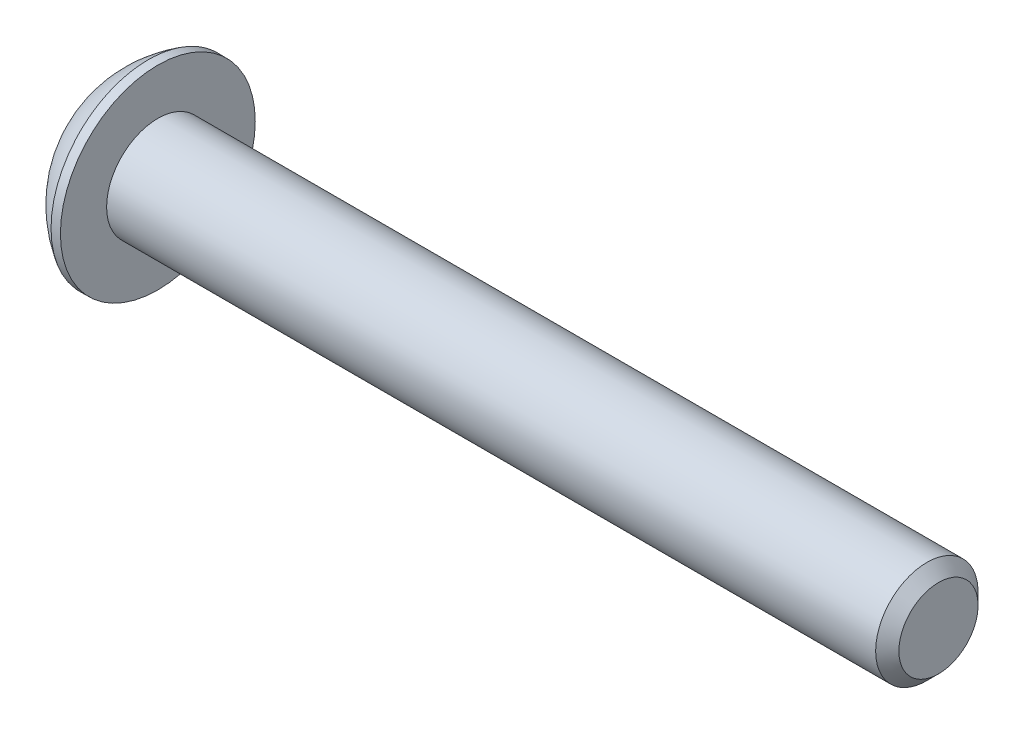
ISO-10303-21;
HEADER;
FILE_DESCRIPTION(('STEP AP214'),'2;1');
FILE_NAME('part.step','',(''),(''),'','','');
FILE_SCHEMA(('AUTOMOTIVE_DESIGN { 1 0 10303 214 1 1 1 1 }'));
ENDSEC;
DATA;
#1=APPLICATION_CONTEXT('core data for automotive mechanical design processes');
#2=APPLICATION_PROTOCOL_DEFINITION('international standard','automotive_design',2000,#1);
#3=PRODUCT_CONTEXT('',#1,'mechanical');
#4=PRODUCT('Part','Part','',(#3));
#5=PRODUCT_RELATED_PRODUCT_CATEGORY('part','',(#4));
#6=PRODUCT_DEFINITION_FORMATION('','',#4);
#7=PRODUCT_DEFINITION_CONTEXT('part definition',#1,'design');
#8=PRODUCT_DEFINITION('design','',#6,#7);
#9=PRODUCT_DEFINITION_SHAPE('','',#8);
#10=(LENGTH_UNIT() NAMED_UNIT(*) SI_UNIT(.MILLI.,.METRE.));
#11=(NAMED_UNIT(*) PLANE_ANGLE_UNIT() SI_UNIT($,.RADIAN.));
#12=(NAMED_UNIT(*) SI_UNIT($,.STERADIAN.) SOLID_ANGLE_UNIT());
#13=UNCERTAINTY_MEASURE_WITH_UNIT(LENGTH_MEASURE(1.E-05),#10,'distance_accuracy_value','');
#14=(GEOMETRIC_REPRESENTATION_CONTEXT(3) GLOBAL_UNCERTAINTY_ASSIGNED_CONTEXT((#13)) GLOBAL_UNIT_ASSIGNED_CONTEXT((#10,
#11,#12)) REPRESENTATION_CONTEXT('',''));
#15=CARTESIAN_POINT('',(0.,0.,0.));
#16=DIRECTION('',(0.,0.,1.));
#17=DIRECTION('',(1.,0.,0.));
#18=AXIS2_PLACEMENT_3D('',#15,#16,#17);
#19=CARTESIAN_POINT('',(1.32080000000034,0.,0.));
#20=DIRECTION('',(-1.,0.,0.));
#21=DIRECTION('',(0.,0.,1.));
#22=AXIS2_PLACEMENT_3D('',#19,#20,#21);
#23=CONICAL_SURFACE('',#22,1.1937999999998,1.04719755119608);
#24=CARTESIAN_POINT('',(2.01004075135902,0.,4.44089209850063E-13));
#25=VERTEX_POINT('',#24);
#26=VERTEX_LOOP('',#25);
#27=FACE_BOUND('',#26,.T.);
#28=CARTESIAN_POINT('',(1.32080000000009,0.,0.));
#29=DIRECTION('',(-1.,0.,0.));
#30=DIRECTION('',(0.,0.,1.));
#31=AXIS2_PLACEMENT_3D('',#28,#29,#30);
#32=CIRCLE('',#31,1.19380000000024);
#33=CARTESIAN_POINT('',(1.32080000000004,-1.03386112703797,0.59690000000006));
#34=VERTEX_POINT('',#33);
#35=CARTESIAN_POINT('',(1.32080000000004,0.,1.19380000000012));
#36=VERTEX_POINT('',#35);
#37=EDGE_CURVE('E19',#34,#36,#32,.T.);
#38=ORIENTED_EDGE('',*,*,#37,.T.);
#39=CARTESIAN_POINT('',(1.32080000000009,0.,0.));
#40=DIRECTION('',(-1.,0.,0.));
#41=DIRECTION('',(0.,0.,1.));
#42=AXIS2_PLACEMENT_3D('',#39,#40,#41);
#43=CIRCLE('',#42,1.19380000000024);
#44=CARTESIAN_POINT('',(1.32080000000004,1.03386112703797,0.596900000000061));
#45=VERTEX_POINT('',#44);
#46=EDGE_CURVE('E147',#36,#45,#43,.T.);
#47=ORIENTED_EDGE('',*,*,#46,.T.);
#48=CARTESIAN_POINT('',(1.32080000000009,0.,0.));
#49=DIRECTION('',(-1.,0.,0.));
#50=DIRECTION('',(0.,0.,1.));
#51=AXIS2_PLACEMENT_3D('',#48,#49,#50);
#52=CIRCLE('',#51,1.19380000000024);
#53=CARTESIAN_POINT('',(1.32080000000004,1.03386112703797,-0.596900000000061));
#54=VERTEX_POINT('',#53);
#55=EDGE_CURVE('E317',#45,#54,#52,.T.);
#56=ORIENTED_EDGE('',*,*,#55,.T.);
#57=CARTESIAN_POINT('',(1.32080000000009,0.,0.));
#58=DIRECTION('',(-1.,0.,0.));
#59=DIRECTION('',(0.,0.,1.));
#60=AXIS2_PLACEMENT_3D('',#57,#58,#59);
#61=CIRCLE('',#60,1.19380000000024);
#62=CARTESIAN_POINT('',(1.32080000000004,1.49457637585666E-12,-1.19380000000012));
#63=VERTEX_POINT('',#62);
#64=EDGE_CURVE('E318',#54,#63,#61,.T.);
#65=ORIENTED_EDGE('',*,*,#64,.T.);
#66=CARTESIAN_POINT('',(1.32080000000009,0.,0.));
#67=DIRECTION('',(-1.,0.,0.));
#68=DIRECTION('',(0.,0.,1.));
#69=AXIS2_PLACEMENT_3D('',#66,#67,#68);
#70=CIRCLE('',#69,1.19380000000024);
#71=CARTESIAN_POINT('',(1.32080000000004,-1.03386112703797,-0.59690000000006));
#72=VERTEX_POINT('',#71);
#73=EDGE_CURVE('E92',#63,#72,#70,.T.);
#74=ORIENTED_EDGE('',*,*,#73,.T.);
#75=CARTESIAN_POINT('',(1.32080000000009,0.,0.));
#76=DIRECTION('',(-1.,0.,0.));
#77=DIRECTION('',(0.,0.,1.));
#78=AXIS2_PLACEMENT_3D('',#75,#76,#77);
#79=CIRCLE('',#78,1.19380000000024);
#80=EDGE_CURVE('E88',#72,#34,#79,.T.);
#81=ORIENTED_EDGE('',*,*,#80,.T.);
#82=EDGE_LOOP('',(#38,#47,#56,#65,#74,#81));
#83=FACE_BOUND('',#82,.T.);
#84=ADVANCED_FACE('F16',(#27,#83),#23,.F.);
#85=CARTESIAN_POINT('',(1.3208,-2.06772225407572,-1.1938));
#86=DIRECTION('',(1.,0.,0.));
#87=DIRECTION('',(0.,0.,-1.));
#88=AXIS2_PLACEMENT_3D('',#85,#86,#87);
#89=PLANE('',#88);
#90=DIRECTION('',(0.,0.5,0.866025403784439));
#91=VECTOR('',#90,1.);
#92=CARTESIAN_POINT('',(1.3208,-1.37848150271715,0.));
#93=LINE('',#92,#91);
#94=CARTESIAN_POINT('',(1.3208,-0.689240751358574,1.1938));
#95=VERTEX_POINT('',#94);
#96=EDGE_CURVE('E100',#95,#34,#93,.F.);
#97=ORIENTED_EDGE('',*,*,#96,.F.);
#98=DIRECTION('',(0.,1.,0.));
#99=VECTOR('',#98,1.);
#100=CARTESIAN_POINT('',(1.3208,-0.689240751358574,1.1938));
#101=LINE('',#100,#99);
#102=EDGE_CURVE('E102',#36,#95,#101,.F.);
#103=ORIENTED_EDGE('',*,*,#102,.F.);
#104=ORIENTED_EDGE('',*,*,#37,.F.);
#105=EDGE_LOOP('',(#97,#103,#104));
#106=FACE_BOUND('',#105,.T.);
#107=ADVANCED_FACE('F98',(#106),#89,.F.);
#108=CARTESIAN_POINT('',(1.3208,-2.06772225407572,-1.1938));
#109=DIRECTION('',(1.,0.,0.));
#110=DIRECTION('',(0.,0.,-1.));
#111=AXIS2_PLACEMENT_3D('',#108,#109,#110);
#112=PLANE('',#111);
#113=DIRECTION('',(0.,-0.5,0.866025403784439));
#114=VECTOR('',#113,1.);
#115=CARTESIAN_POINT('',(1.3208,-0.689240751358574,-1.1938));
#116=LINE('',#115,#114);
#117=CARTESIAN_POINT('',(1.3208,-1.37848150271715,0.));
#118=VERTEX_POINT('',#117);
#119=EDGE_CURVE('E108',#118,#72,#116,.F.);
#120=ORIENTED_EDGE('',*,*,#119,.F.);
#121=DIRECTION('',(0.,0.5,0.866025403784439));
#122=VECTOR('',#121,1.);
#123=CARTESIAN_POINT('',(1.3208,-1.37848150271715,0.));
#124=LINE('',#123,#122);
#125=EDGE_CURVE('E105',#34,#118,#124,.F.);
#126=ORIENTED_EDGE('',*,*,#125,.F.);
#127=ORIENTED_EDGE('',*,*,#80,.F.);
#128=EDGE_LOOP('',(#120,#126,#127));
#129=FACE_BOUND('',#128,.T.);
#130=ADVANCED_FACE('F106',(#129),#112,.F.);
#131=CARTESIAN_POINT('',(1.3208,-2.06772225407572,-1.1938));
#132=DIRECTION('',(1.,0.,0.));
#133=DIRECTION('',(0.,0.,-1.));
#134=AXIS2_PLACEMENT_3D('',#131,#132,#133);
#135=PLANE('',#134);
#136=DIRECTION('',(0.,1.,0.));
#137=VECTOR('',#136,1.);
#138=CARTESIAN_POINT('',(1.3208,0.689240751358577,-1.1938));
#139=LINE('',#138,#137);
#140=CARTESIAN_POINT('',(1.3208,-0.689240751358574,-1.1938));
#141=VERTEX_POINT('',#140);
#142=EDGE_CURVE('E287',#141,#63,#139,.T.);
#143=ORIENTED_EDGE('',*,*,#142,.F.);
#144=DIRECTION('',(0.,-0.5,0.866025403784439));
#145=VECTOR('',#144,1.);
#146=CARTESIAN_POINT('',(1.3208,-0.689240751358574,-1.1938));
#147=LINE('',#146,#145);
#148=EDGE_CURVE('E299',#72,#141,#147,.F.);
#149=ORIENTED_EDGE('',*,*,#148,.F.);
#150=ORIENTED_EDGE('',*,*,#73,.F.);
#151=EDGE_LOOP('',(#143,#149,#150));
#152=FACE_BOUND('',#151,.T.);
#153=ADVANCED_FACE('F190',(#152),#135,.F.);
#154=CARTESIAN_POINT('',(1.3208,-2.06772225407572,-1.1938));
#155=DIRECTION('',(1.,0.,0.));
#156=DIRECTION('',(0.,0.,-1.));
#157=AXIS2_PLACEMENT_3D('',#154,#155,#156);
#158=PLANE('',#157);
#159=DIRECTION('',(0.,-0.5,-0.866025403784439));
#160=VECTOR('',#159,1.);
#161=CARTESIAN_POINT('',(1.3208,1.37848150271715,0.));
#162=LINE('',#161,#160);
#163=CARTESIAN_POINT('',(1.3208,0.689240751358577,-1.1938));
#164=VERTEX_POINT('',#163);
#165=EDGE_CURVE('E273',#164,#54,#162,.F.);
#166=ORIENTED_EDGE('',*,*,#165,.F.);
#167=DIRECTION('',(0.,1.,0.));
#168=VECTOR('',#167,1.);
#169=CARTESIAN_POINT('',(1.3208,0.689240751358577,-1.1938));
#170=LINE('',#169,#168);
#171=EDGE_CURVE('E284',#63,#164,#170,.T.);
#172=ORIENTED_EDGE('',*,*,#171,.F.);
#173=ORIENTED_EDGE('',*,*,#64,.F.);
#174=EDGE_LOOP('',(#166,#172,#173));
#175=FACE_BOUND('',#174,.T.);
#176=ADVANCED_FACE('F186',(#175),#158,.F.);
#177=CARTESIAN_POINT('',(1.3208,-2.06772225407572,-1.1938));
#178=DIRECTION('',(1.,0.,0.));
#179=DIRECTION('',(0.,0.,-1.));
#180=AXIS2_PLACEMENT_3D('',#177,#178,#179);
#181=PLANE('',#180);
#182=DIRECTION('',(0.,0.5,-0.866025403784439));
#183=VECTOR('',#182,1.);
#184=CARTESIAN_POINT('',(1.3208,0.689240751358576,1.1938));
#185=LINE('',#184,#183);
#186=CARTESIAN_POINT('',(1.3208,1.37848150271715,0.));
#187=VERTEX_POINT('',#186);
#188=EDGE_CURVE('E252',#187,#45,#185,.F.);
#189=ORIENTED_EDGE('',*,*,#188,.F.);
#190=DIRECTION('',(0.,-0.5,-0.866025403784439));
#191=VECTOR('',#190,1.);
#192=CARTESIAN_POINT('',(1.3208,1.37848150271715,0.));
#193=LINE('',#192,#191);
#194=EDGE_CURVE('E271',#54,#187,#193,.F.);
#195=ORIENTED_EDGE('',*,*,#194,.F.);
#196=ORIENTED_EDGE('',*,*,#55,.F.);
#197=EDGE_LOOP('',(#189,#195,#196));
#198=FACE_BOUND('',#197,.T.);
#199=ADVANCED_FACE('F182',(#198),#181,.F.);
#200=CARTESIAN_POINT('',(1.3208,-2.06772225407572,-1.1938));
#201=DIRECTION('',(1.,0.,0.));
#202=DIRECTION('',(0.,0.,-1.));
#203=AXIS2_PLACEMENT_3D('',#200,#201,#202);
#204=PLANE('',#203);
#205=DIRECTION('',(0.,1.,0.));
#206=VECTOR('',#205,1.);
#207=CARTESIAN_POINT('',(1.3208,-0.689240751358574,1.1938));
#208=LINE('',#207,#206);
#209=CARTESIAN_POINT('',(1.3208,0.689240751358576,1.1938));
#210=VERTEX_POINT('',#209);
#211=EDGE_CURVE('E117',#210,#36,#208,.F.);
#212=ORIENTED_EDGE('',*,*,#211,.F.);
#213=DIRECTION('',(0.,0.5,-0.866025403784439));
#214=VECTOR('',#213,1.);
#215=CARTESIAN_POINT('',(1.3208,0.689240751358576,1.1938));
#216=LINE('',#215,#214);
#217=EDGE_CURVE('E255',#45,#210,#216,.F.);
#218=ORIENTED_EDGE('',*,*,#217,.F.);
#219=ORIENTED_EDGE('',*,*,#46,.F.);
#220=EDGE_LOOP('',(#212,#218,#219));
#221=FACE_BOUND('',#220,.T.);
#222=ADVANCED_FACE('F178',(#221),#204,.F.);
#223=CARTESIAN_POINT('',(1.3208,-0.689240751358574,1.1938));
#224=DIRECTION('',(0.,0.,-1.));
#225=DIRECTION('',(0.,1.,0.));
#226=AXIS2_PLACEMENT_3D('',#223,#224,#225);
#227=PLANE('',#226);
#228=DIRECTION('',(0.,1.,0.));
#229=VECTOR('',#228,1.);
#230=CARTESIAN_POINT('',(0.,0.,1.1938));
#231=LINE('',#230,#229);
#232=CARTESIAN_POINT('',(0.,0.689240751358577,1.1938));
#233=VERTEX_POINT('',#232);
#234=CARTESIAN_POINT('',(0.,-0.689240751358574,1.1938));
#235=VERTEX_POINT('',#234);
#236=EDGE_CURVE('E249',#233,#235,#231,.F.);
#237=ORIENTED_EDGE('',*,*,#236,.F.);
#238=DIRECTION('',(1.,0.,0.));
#239=VECTOR('',#238,1.);
#240=CARTESIAN_POINT('',(1.3208,0.689240751358576,1.1938));
#241=LINE('',#240,#239);
#242=EDGE_CURVE('E261',#210,#233,#241,.F.);
#243=ORIENTED_EDGE('',*,*,#242,.F.);
#244=ORIENTED_EDGE('',*,*,#211,.T.);
#245=ORIENTED_EDGE('',*,*,#102,.T.);
#246=DIRECTION('',(1.,0.,0.));
#247=VECTOR('',#246,1.);
#248=CARTESIAN_POINT('',(1.3208,-0.689240751358574,1.1938));
#249=LINE('',#248,#247);
#250=EDGE_CURVE('E111',#235,#95,#249,.T.);
#251=ORIENTED_EDGE('',*,*,#250,.F.);
#252=EDGE_LOOP('',(#237,#243,#244,#245,#251));
#253=FACE_BOUND('',#252,.T.);
#254=ADVANCED_FACE('F175',(#253),#227,.T.);
#255=CARTESIAN_POINT('',(1.3208,-1.37848150271715,0.));
#256=DIRECTION('',(0.,0.866025403784439,-0.5));
#257=DIRECTION('',(0.,0.5,0.866025403784439));
#258=AXIS2_PLACEMENT_3D('',#255,#256,#257);
#259=PLANE('',#258);
#260=DIRECTION('',(0.,-0.5,-0.866025403784439));
#261=VECTOR('',#260,1.);
#262=CARTESIAN_POINT('',(0.,-0.689240751358574,1.1938));
#263=LINE('',#262,#261);
#264=CARTESIAN_POINT('',(0.,-1.37848150271715,0.));
#265=VERTEX_POINT('',#264);
#266=EDGE_CURVE('E246',#235,#265,#263,.T.);
#267=ORIENTED_EDGE('',*,*,#266,.F.);
#268=ORIENTED_EDGE('',*,*,#250,.T.);
#269=ORIENTED_EDGE('',*,*,#96,.T.);
#270=ORIENTED_EDGE('',*,*,#125,.T.);
#271=DIRECTION('',(1.,0.,0.));
#272=VECTOR('',#271,1.);
#273=CARTESIAN_POINT('',(1.3208,-1.37848150271715,0.));
#274=LINE('',#273,#272);
#275=EDGE_CURVE('E296',#265,#118,#274,.T.);
#276=ORIENTED_EDGE('',*,*,#275,.F.);
#277=EDGE_LOOP('',(#267,#268,#269,#270,#276));
#278=FACE_BOUND('',#277,.T.);
#279=ADVANCED_FACE('F115',(#278),#259,.T.);
#280=CARTESIAN_POINT('',(1.3208,-0.689240751358574,-1.1938));
#281=DIRECTION('',(0.,0.866025403784439,0.5));
#282=DIRECTION('',(0.,-0.5,0.866025403784439));
#283=AXIS2_PLACEMENT_3D('',#280,#281,#282);
#284=PLANE('',#283);
#285=DIRECTION('',(0.,0.5,-0.866025403784439));
#286=VECTOR('',#285,1.);
#287=CARTESIAN_POINT('',(0.,-1.37848150271715,0.));
#288=LINE('',#287,#286);
#289=CARTESIAN_POINT('',(0.,-0.689240751358574,-1.1938));
#290=VERTEX_POINT('',#289);
#291=EDGE_CURVE('E243',#265,#290,#288,.T.);
#292=ORIENTED_EDGE('',*,*,#291,.F.);
#293=ORIENTED_EDGE('',*,*,#275,.T.);
#294=ORIENTED_EDGE('',*,*,#119,.T.);
#295=ORIENTED_EDGE('',*,*,#148,.T.);
#296=DIRECTION('',(1.,0.,0.));
#297=VECTOR('',#296,1.);
#298=CARTESIAN_POINT('',(1.3208,-0.689240751358574,-1.1938));
#299=LINE('',#298,#297);
#300=EDGE_CURVE('E281',#290,#141,#299,.T.);
#301=ORIENTED_EDGE('',*,*,#300,.F.);
#302=EDGE_LOOP('',(#292,#293,#294,#295,#301));
#303=FACE_BOUND('',#302,.T.);
#304=ADVANCED_FACE('F168',(#303),#284,.T.);
#305=CARTESIAN_POINT('',(1.3208,0.689240751358577,-1.1938));
#306=DIRECTION('',(0.,0.,1.));
#307=DIRECTION('',(1.,0.,0.));
#308=AXIS2_PLACEMENT_3D('',#305,#306,#307);
#309=PLANE('',#308);
#310=DIRECTION('',(0.,1.,0.));
#311=VECTOR('',#310,1.);
#312=CARTESIAN_POINT('',(0.,0.,-1.1938));
#313=LINE('',#312,#311);
#314=CARTESIAN_POINT('',(0.,0.689240751358577,-1.1938));
#315=VERTEX_POINT('',#314);
#316=EDGE_CURVE('E240',#290,#315,#313,.T.);
#317=ORIENTED_EDGE('',*,*,#316,.F.);
#318=ORIENTED_EDGE('',*,*,#300,.T.);
#319=ORIENTED_EDGE('',*,*,#142,.T.);
#320=ORIENTED_EDGE('',*,*,#171,.T.);
#321=DIRECTION('',(1.,0.,0.));
#322=VECTOR('',#321,1.);
#323=CARTESIAN_POINT('',(1.3208,0.689240751358577,-1.1938));
#324=LINE('',#323,#322);
#325=EDGE_CURVE('E256',#315,#164,#324,.T.);
#326=ORIENTED_EDGE('',*,*,#325,.F.);
#327=EDGE_LOOP('',(#317,#318,#319,#320,#326));
#328=FACE_BOUND('',#327,.T.);
#329=ADVANCED_FACE('F165',(#328),#309,.T.);
#330=CARTESIAN_POINT('',(1.3208,1.37848150271715,0.));
#331=DIRECTION('',(0.,-0.866025403784439,0.5));
#332=DIRECTION('',(0.,-0.5,-0.866025403784439));
#333=AXIS2_PLACEMENT_3D('',#330,#331,#332);
#334=PLANE('',#333);
#335=DIRECTION('',(0.,0.5,0.866025403784439));
#336=VECTOR('',#335,1.);
#337=CARTESIAN_POINT('',(0.,0.689240751358577,-1.1938));
#338=LINE('',#337,#336);
#339=CARTESIAN_POINT('',(0.,1.37848150271715,0.));
#340=VERTEX_POINT('',#339);
#341=EDGE_CURVE('E237',#315,#340,#338,.T.);
#342=ORIENTED_EDGE('',*,*,#341,.F.);
#343=ORIENTED_EDGE('',*,*,#325,.T.);
#344=ORIENTED_EDGE('',*,*,#165,.T.);
#345=ORIENTED_EDGE('',*,*,#194,.T.);
#346=DIRECTION('',(1.,0.,0.));
#347=VECTOR('',#346,1.);
#348=CARTESIAN_POINT('',(1.3208,1.37848150271715,0.));
#349=LINE('',#348,#347);
#350=EDGE_CURVE('E34',#340,#187,#349,.T.);
#351=ORIENTED_EDGE('',*,*,#350,.F.);
#352=EDGE_LOOP('',(#342,#343,#344,#345,#351));
#353=FACE_BOUND('',#352,.T.);
#354=ADVANCED_FACE('F161',(#353),#334,.T.);
#355=CARTESIAN_POINT('',(1.3208,0.689240751358576,1.1938));
#356=DIRECTION('',(0.,-0.866025403784439,-0.5));
#357=DIRECTION('',(0.,0.5,-0.866025403784439));
#358=AXIS2_PLACEMENT_3D('',#355,#356,#357);
#359=PLANE('',#358);
#360=DIRECTION('',(0.,-0.5,0.866025403784439));
#361=VECTOR('',#360,1.);
#362=CARTESIAN_POINT('',(0.,1.37848150271715,0.));
#363=LINE('',#362,#361);
#364=EDGE_CURVE('E146',#340,#233,#363,.T.);
#365=ORIENTED_EDGE('',*,*,#364,.F.);
#366=ORIENTED_EDGE('',*,*,#350,.T.);
#367=ORIENTED_EDGE('',*,*,#188,.T.);
#368=ORIENTED_EDGE('',*,*,#217,.T.);
#369=ORIENTED_EDGE('',*,*,#242,.T.);
#370=EDGE_LOOP('',(#365,#366,#367,#368,#369));
#371=FACE_BOUND('',#370,.T.);
#372=ADVANCED_FACE('F157',(#371),#359,.T.);
#373=CARTESIAN_POINT('',(0.,0.,0.));
#374=DIRECTION('',(-1.,0.,0.));
#375=DIRECTION('',(0.,0.,1.));
#376=AXIS2_PLACEMENT_3D('',#373,#374,#375);
#377=PLANE('',#376);
#378=ORIENTED_EDGE('',*,*,#341,.T.);
#379=ORIENTED_EDGE('',*,*,#364,.T.);
#380=ORIENTED_EDGE('',*,*,#236,.T.);
#381=ORIENTED_EDGE('',*,*,#266,.T.);
#382=ORIENTED_EDGE('',*,*,#291,.T.);
#383=ORIENTED_EDGE('',*,*,#316,.T.);
#384=EDGE_LOOP('',(#378,#379,#380,#381,#382,#383));
#385=FACE_BOUND('',#384,.T.);
#386=CARTESIAN_POINT('',(0.,1.9812,0.));
#387=CARTESIAN_POINT('',(0.,1.9811996664299,0.0556258831179428));
#388=CARTESIAN_POINT('',(0.,1.97885520380442,0.111261989398606));
#389=CARTESIAN_POINT('',(0.,1.96949260169541,0.222149719830458));
#390=CARTESIAN_POINT('',(0.,1.96247308239605,0.277401225602895));
#391=CARTESIAN_POINT('',(0.,1.94379192841038,0.387209508139747));
#392=CARTESIAN_POINT('',(-1.85325793235264E-13,1.93212292489526,0.441765039546365));
#393=CARTESIAN_POINT('',(1.86344214223505E-13,1.90422331175315,0.549729449347493));
#394=CARTESIAN_POINT('',(6.94543371897454E-13,1.88798900035338,0.603137359208869));
#395=CARTESIAN_POINT('',(1.15501975216981E-12,1.83266214476501,0.760839131321828));
#396=CARTESIAN_POINT('',(0.,1.78690023648845,0.862876433575429));
#397=CARTESIAN_POINT('',(0.,1.67887358150667,1.05780719540872));
#398=CARTESIAN_POINT('',(9.54193214892627E-13,1.6166082074585,1.15070030720801));
#399=CARTESIAN_POINT('',(5.94805591894675E-13,1.51224157140982,1.28116890915697));
#400=CARTESIAN_POINT('',(1.63221293851378E-13,1.4755970394354,1.32320451127026));
#401=CARTESIAN_POINT('',(-1.62196980336157E-13,1.39893832619713,1.40400288695709));
#402=CARTESIAN_POINT('',(0.,1.35892742784698,1.44276877695455));
#403=CARTESIAN_POINT('',(1.14362537325405E-13,1.23416504602197,1.55382272417904));
#404=CARTESIAN_POINT('',(0.,1.14466125559859,1.62089527952111));
#405=CARTESIAN_POINT('',(0.,0.955712144178167,1.7390221808118));
#406=CARTESIAN_POINT('',(0.,0.856267198233564,1.79007713076007));
#407=CARTESIAN_POINT('',(0.,0.650206345910843,1.87477637530954));
#408=CARTESIAN_POINT('',(0.,0.543590516134855,1.90842085586267));
#409=CARTESIAN_POINT('',(0.,0.326226155292018,1.95733039300656));
#410=CARTESIAN_POINT('',(0.,0.21547760215793,1.97259535144288));
#411=CARTESIAN_POINT('',(0.,-0.00701040587544639,1.98431697865418));
#412=CARTESIAN_POINT('',(0.,-0.118749860774734,1.98077364742917));
#413=CARTESIAN_POINT('',(0.,-0.340050178355485,1.95497485623825));
#414=CARTESIAN_POINT('',(0.,-0.449611052668255,1.93271949620218));
#415=CARTESIAN_POINT('',(0.,-0.663431110729174,1.87014138774523));
#416=CARTESIAN_POINT('',(0.,-0.76769023783852,1.82981844635272));
#417=CARTESIAN_POINT('',(0.,-0.968005760719347,1.73219968377096));
#418=CARTESIAN_POINT('',(0.,-1.0640618469811,1.6749032225164));
#419=CARTESIAN_POINT('',(0.,-1.19980276751283,1.57757371205873));
#420=CARTESIAN_POINT('',(0.,-1.24366557129213,1.54322665019466));
#421=CARTESIAN_POINT('',(0.,-1.32838995706696,1.47093063174264));
#422=CARTESIAN_POINT('',(0.,-1.36924860178706,1.43297823102439));
#423=CARTESIAN_POINT('',(0.,-1.48674671849223,1.31419842051173));
#424=CARTESIAN_POINT('',(0.,-1.55842832343237,1.22836221289311));
#425=CARTESIAN_POINT('',(0.,-1.6863396856475,1.04586168272493));
#426=CARTESIAN_POINT('',(0.,-1.7425700302488,0.949197771949774));
#427=CARTESIAN_POINT('',(0.,-1.8141614250401,0.798182600298684));
#428=CARTESIAN_POINT('',(0.,-1.83591780585875,0.746776203847791));
#429=CARTESIAN_POINT('',(0.,-1.87500754181092,0.642341081688636));
#430=CARTESIAN_POINT('',(0.,-1.89234447645404,0.589313708122847));
#431=CARTESIAN_POINT('',(0.,-1.92246053433554,0.482076273028395));
#432=CARTESIAN_POINT('',(0.,-1.93524685475118,0.42786822425751));
#433=CARTESIAN_POINT('',(0.,-1.95620937250494,0.318578151844611));
#434=CARTESIAN_POINT('',(0.,-1.96438692958147,0.263496390912872));
#435=CARTESIAN_POINT('',(0.,-1.97388528284653,0.173607715038558));
#436=CARTESIAN_POINT('',(0.,-1.97662743364426,0.138944718024998));
#437=CARTESIAN_POINT('',(0.,-1.98028489645283,0.0695224782567002));
#438=CARTESIAN_POINT('',(0.,-1.98120020846367,0.0347632355019631));
#439=CARTESIAN_POINT('',(0.,-1.9811996664299,-0.0556258831179437));
#440=CARTESIAN_POINT('',(0.,-1.97885520380442,-0.111261989398607));
#441=CARTESIAN_POINT('',(0.,-1.96949260169541,-0.222149719830459));
#442=CARTESIAN_POINT('',(0.,-1.96247308239605,-0.277401225602897));
#443=CARTESIAN_POINT('',(0.,-1.94379192841039,-0.387209508139749));
#444=CARTESIAN_POINT('',(-1.85269749640691E-13,-1.93212292489526,-0.441765039546367));
#445=CARTESIAN_POINT('',(1.86288125054388E-13,-1.90422331175315,-0.549729449347495));
#446=CARTESIAN_POINT('',(6.94525090263764E-13,-1.88798900035338,-0.603137359208872));
#447=CARTESIAN_POINT('',(1.15505622829081E-12,-1.83266214476501,-0.760839131321831));
#448=CARTESIAN_POINT('',(0.,-1.78690023648845,-0.862876433575431));
#449=CARTESIAN_POINT('',(0.,-1.67887358150667,-1.05780719540872));
#450=CARTESIAN_POINT('',(9.54248812869379E-13,-1.6166082074585,-1.15070030720801));
#451=CARTESIAN_POINT('',(5.94777756479239E-13,-1.51224157140982,-1.28116890915698));
#452=CARTESIAN_POINT('',(1.63138949183833E-13,-1.47559703943539,-1.32320451127027));
#453=CARTESIAN_POINT('',(-1.62114715061273E-13,-1.39893832619713,-1.40400288695709));
#454=CARTESIAN_POINT('',(0.,-1.35892742784699,-1.44276877695455));
#455=CARTESIAN_POINT('',(1.13760489124207E-13,-1.23416504602197,-1.55382272417904));
#456=CARTESIAN_POINT('',(0.,-1.14466125559859,-1.62089527952111));
#457=CARTESIAN_POINT('',(0.,-0.95571214417816,-1.73902218081179));
#458=CARTESIAN_POINT('',(0.,-0.856267198233559,-1.79007713076007));
#459=CARTESIAN_POINT('',(0.,-0.650206345910841,-1.87477637530954));
#460=CARTESIAN_POINT('',(0.,-0.543590516134854,-1.90842085586267));
#461=CARTESIAN_POINT('',(0.,-0.326226155292018,-1.95733039300657));
#462=CARTESIAN_POINT('',(0.,-0.215477602157929,-1.97259535144288));
#463=CARTESIAN_POINT('',(0.,0.0070104058754487,-1.98431697865418));
#464=CARTESIAN_POINT('',(0.,0.118749860774737,-1.98077364742916));
#465=CARTESIAN_POINT('',(0.,0.340050178355489,-1.95497485623824));
#466=CARTESIAN_POINT('',(0.,0.44961105266826,-1.93271949620218));
#467=CARTESIAN_POINT('',(0.,0.663431110729178,-1.87014138774524));
#468=CARTESIAN_POINT('',(0.,0.767690237838524,-1.82981844635272));
#469=CARTESIAN_POINT('',(0.,0.968005760719348,-1.73219968377096));
#470=CARTESIAN_POINT('',(0.,1.0640618469811,-1.67490322251639));
#471=CARTESIAN_POINT('',(0.,1.19980276751283,-1.57757371205873));
#472=CARTESIAN_POINT('',(0.,1.24366557129214,-1.54322665019465));
#473=CARTESIAN_POINT('',(0.,1.32838995706696,-1.47093063174263));
#474=CARTESIAN_POINT('',(0.,1.36924860178706,-1.43297823102439));
#475=CARTESIAN_POINT('',(0.,1.48674671849223,-1.31419842051172));
#476=CARTESIAN_POINT('',(0.,1.55842832343237,-1.22836221289311));
#477=CARTESIAN_POINT('',(0.,1.6863396856475,-1.04586168272492));
#478=CARTESIAN_POINT('',(0.,1.7425700302488,-0.949197771949768));
#479=CARTESIAN_POINT('',(0.,1.8141614250401,-0.798182600298677));
#480=CARTESIAN_POINT('',(0.,1.83591780585875,-0.746776203847785));
#481=CARTESIAN_POINT('',(0.,1.87500754181092,-0.64234108168863));
#482=CARTESIAN_POINT('',(0.,1.89234447645404,-0.589313708122841));
#483=CARTESIAN_POINT('',(0.,1.92246053433555,-0.482076273028389));
#484=CARTESIAN_POINT('',(0.,1.93524685475118,-0.427868224257505));
#485=CARTESIAN_POINT('',(0.,1.95620937250494,-0.318578151844605));
#486=CARTESIAN_POINT('',(0.,1.96438692958147,-0.263496390912866));
#487=CARTESIAN_POINT('',(0.,1.97388528284653,-0.173607715038553));
#488=CARTESIAN_POINT('',(0.,1.97662743364426,-0.138944718024994));
#489=CARTESIAN_POINT('',(0.,1.98028489645283,-0.0695224782566989));
#490=CARTESIAN_POINT('',(0.,1.98120020846367,-0.034763235501963));
#491=CARTESIAN_POINT('',(0.,1.9812,0.));
#492=B_SPLINE_CURVE_WITH_KNOTS('',3,(#386,#387,#388,#389,#390,#391,#392,#393,#394,#395,#396,
#397,#398,#399,#400,#401,#402,#403,#404,#405,#406,#407,#408,#409,#410,#411,#412,#413,#414,#415,
#416,#417,#418,#419,#420,#421,#422,#423,#424,#425,#426,#427,#428,#429,#430,#431,#432,#433,#434,
#435,#436,#437,#438,#439,#440,#441,#442,#443,#444,#445,#446,#447,#448,#449,#450,#451,#452,#453,
#454,#455,#456,#457,#458,#459,#460,#461,#462,#463,#464,#465,#466,#467,#468,#469,#470,#471,#472,
#473,#474,#475,#476,#477,#478,#479,#480,#481,#482,#483,#484,#485,#486,#487,#488,#489,#490,#491),
.UNSPECIFIED.,.T.,.F.,(4,2,2,2,2,2,2,2,2,2,2,2,2,2,2,2,2,2,2,2,2,2,2,2,2,2,2,2,2,2,2,2,2,2,2,2,
2,2,2,2,2,2,2,2,2,2,2,2,2,2,2,2,4),(0.,0.166845646007828,0.333740557374255,0.500901034367693,
0.668197445942386,1.00199278686282,1.33580081809885,1.50292354032982,1.6698851310853,
2.00370118900129,2.33750465770544,2.67130456115909,3.005106247238,3.33890793331696,
3.67270783677065,4.00651130547476,4.34032736339026,4.50728895414554,4.67441167637632,
5.00821970761259,5.34201504853332,5.50931146010827,5.67647193710191,5.84336684846844,
6.0102124944764,6.11448220058334,6.21875190669029,6.38559755269812,6.55249246406454,
6.71965294105798,6.88694935263268,7.22074469355311,7.55455272478915,7.72167544702011,
7.88863703777559,8.22245309569158,8.55625656439573,8.89005646784938,9.2238581539283,
9.55765984000725,9.89145974346094,10.2252632121651,10.5590792700806,10.7260408608358,
10.8931635830666,11.2269716143029,11.5607669552236,11.7280633667986,11.8952238437922,
12.0621187551587,12.2289644011667,12.3332341072736,12.4375038133806),.UNSPECIFIED.);
#493=CARTESIAN_POINT('',(0.,1.9812,0.));
#494=VERTEX_POINT('',#493);
#495=EDGE_CURVE('E139',#494,#494,#492,.T.);
#496=ORIENTED_EDGE('',*,*,#495,.F.);
#497=EDGE_LOOP('',(#496));
#498=FACE_BOUND('',#497,.T.);
#499=ADVANCED_FACE('F153',(#385,#498),#377,.T.);
#500=CARTESIAN_POINT('',(4.13385,0.,0.));
#501=DIRECTION('',(0.,1.,0.));
#502=DIRECTION('',(1.,0.,0.));
#503=AXIS2_PLACEMENT_3D('',#500,#501,#502);
#504=SPHERICAL_SURFACE('',#503,4.58408870578439);
#505=CARTESIAN_POINT('',(1.8288,0.,0.));
#506=DIRECTION('',(-1.,0.,0.));
#507=DIRECTION('',(0.,0.,1.));
#508=AXIS2_PLACEMENT_3D('',#505,#506,#507);
#509=CIRCLE('',#508,3.9624);
#510=CARTESIAN_POINT('',(1.8288,0.,3.9624));
#511=VERTEX_POINT('',#510);
#512=EDGE_CURVE('E136',#511,#511,#509,.F.);
#513=ORIENTED_EDGE('',*,*,#512,.F.);
#514=EDGE_LOOP('',(#513));
#515=FACE_BOUND('',#514,.T.);
#516=ORIENTED_EDGE('',*,*,#495,.T.);
#517=EDGE_LOOP('',(#516));
#518=FACE_BOUND('',#517,.T.);
#519=ADVANCED_FACE('F149',(#515,#518),#504,.T.);
#520=CARTESIAN_POINT('',(33.9598,0.,0.));
#521=DIRECTION('',(-1.,0.,0.));
#522=DIRECTION('',(0.,0.,1.));
#523=AXIS2_PLACEMENT_3D('',#520,#521,#522);
#524=PLANE('',#523);
#525=CARTESIAN_POINT('',(33.9597999999341,0.,0.));
#526=DIRECTION('',(-1.,0.,0.));
#527=DIRECTION('',(0.,0.,1.));
#528=AXIS2_PLACEMENT_3D('',#525,#526,#527);
#529=CIRCLE('',#528,1.61036000002923);
#530=CARTESIAN_POINT('',(33.9597999999341,0.,1.61036000002923));
#531=VERTEX_POINT('',#530);
#532=EDGE_CURVE('E133',#531,#531,#529,.T.);
#533=ORIENTED_EDGE('',*,*,#532,.F.);
#534=EDGE_LOOP('',(#533));
#535=FACE_BOUND('',#534,.T.);
#536=ADVANCED_FACE('F221',(#535),#524,.F.);
#537=CARTESIAN_POINT('',(0.,0.,0.));
#538=DIRECTION('',(-1.,0.,0.));
#539=DIRECTION('',(0.,0.,1.));
#540=AXIS2_PLACEMENT_3D('',#537,#538,#539);
#541=CYLINDRICAL_SURFACE('',#540,3.9624);
#542=ORIENTED_EDGE('',*,*,#512,.T.);
#543=EDGE_LOOP('',(#542));
#544=FACE_BOUND('',#543,.T.);
#545=CARTESIAN_POINT('',(2.2098,0.,0.));
#546=DIRECTION('',(-1.,0.,0.));
#547=DIRECTION('',(0.,0.,1.));
#548=AXIS2_PLACEMENT_3D('',#545,#546,#547);
#549=CIRCLE('',#548,3.9624);
#550=CARTESIAN_POINT('',(2.2098,0.,3.9624));
#551=VERTEX_POINT('',#550);
#552=EDGE_CURVE('E130',#551,#551,#549,.T.);
#553=ORIENTED_EDGE('',*,*,#552,.T.);
#554=EDGE_LOOP('',(#553));
#555=FACE_BOUND('',#554,.T.);
#556=ADVANCED_FACE('F218',(#544,#555),#541,.T.);
#557=CARTESIAN_POINT('',(33.4873600000378,0.,0.));
#558=DIRECTION('',(-1.,0.,0.));
#559=DIRECTION('',(0.,0.,1.));
#560=AXIS2_PLACEMENT_3D('',#557,#558,#559);
#561=CONICAL_SURFACE('',#560,2.08279999992556,0.785398163397448);
#562=ORIENTED_EDGE('',*,*,#532,.T.);
#563=EDGE_LOOP('',(#562));
#564=FACE_BOUND('',#563,.T.);
#565=CARTESIAN_POINT('',(33.48736,0.,0.));
#566=DIRECTION('',(-1.,0.,0.));
#567=DIRECTION('',(0.,0.,1.));
#568=AXIS2_PLACEMENT_3D('',#565,#566,#567);
#569=CIRCLE('',#568,2.0828);
#570=CARTESIAN_POINT('',(33.48736,0.,2.0828));
#571=VERTEX_POINT('',#570);
#572=EDGE_CURVE('E25',#571,#571,#569,.T.);
#573=ORIENTED_EDGE('',*,*,#572,.F.);
#574=EDGE_LOOP('',(#573));
#575=FACE_BOUND('',#574,.T.);
#576=ADVANCED_FACE('F210',(#564,#575),#561,.T.);
#577=CARTESIAN_POINT('',(2.2098,2.0828,0.));
#578=DIRECTION('',(-1.,0.,0.));
#579=DIRECTION('',(0.,0.,1.));
#580=AXIS2_PLACEMENT_3D('',#577,#578,#579);
#581=PLANE('',#580);
#582=CARTESIAN_POINT('',(2.2098,0.,0.));
#583=DIRECTION('',(-1.,0.,0.));
#584=DIRECTION('',(0.,0.,1.));
#585=AXIS2_PLACEMENT_3D('',#582,#583,#584);
#586=CIRCLE('',#585,2.0828);
#587=CARTESIAN_POINT('',(2.2098,0.,2.0828));
#588=VERTEX_POINT('',#587);
#589=EDGE_CURVE('E10',#588,#588,#586,.F.);
#590=ORIENTED_EDGE('',*,*,#589,.F.);
#591=EDGE_LOOP('',(#590));
#592=FACE_BOUND('',#591,.T.);
#593=ORIENTED_EDGE('',*,*,#552,.F.);
#594=EDGE_LOOP('',(#593));
#595=FACE_BOUND('',#594,.T.);
#596=ADVANCED_FACE('F204',(#592,#595),#581,.F.);
#597=CARTESIAN_POINT('',(0.,0.,0.));
#598=DIRECTION('',(-1.,0.,0.));
#599=DIRECTION('',(0.,0.,1.));
#600=AXIS2_PLACEMENT_3D('',#597,#598,#599);
#601=CYLINDRICAL_SURFACE('',#600,2.0828);
#602=ORIENTED_EDGE('',*,*,#572,.T.);
#603=EDGE_LOOP('',(#602));
#604=FACE_BOUND('',#603,.T.);
#605=ORIENTED_EDGE('',*,*,#589,.T.);
#606=EDGE_LOOP('',(#605));
#607=FACE_BOUND('',#606,.T.);
#608=ADVANCED_FACE('F202',(#604,#607),#601,.T.);
#609=CLOSED_SHELL('',(#84,#107,#130,#153,#176,#199,#222,#254,#279,#304,#329,#354,#372,#499,#519,
#536,#556,#576,#596,#608));
#610=MANIFOLD_SOLID_BREP('B1',#609);
#611=ADVANCED_BREP_SHAPE_REPRESENTATION('',(#18,#610),#14);
#612=SHAPE_DEFINITION_REPRESENTATION(#9,#611);
ENDSEC;
END-ISO-10303-21;
